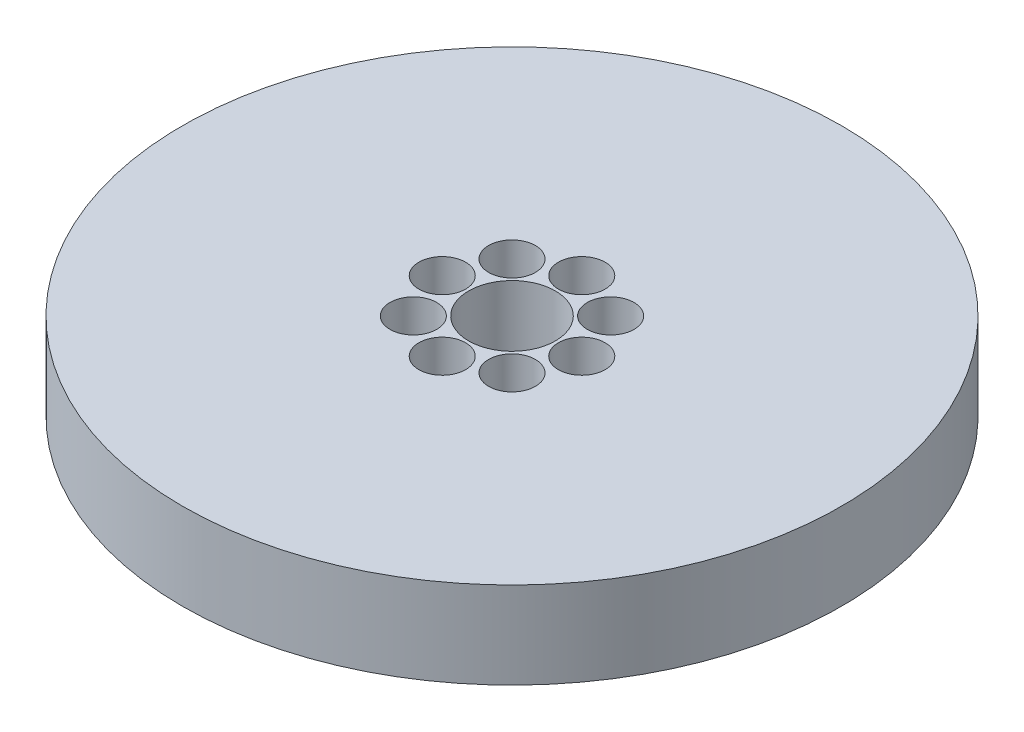
ISO-10303-21;
HEADER;
FILE_DESCRIPTION(('STEP AP214'),'2;1');
FILE_NAME('part.step','',(''),(''),'','','');
FILE_SCHEMA(('AUTOMOTIVE_DESIGN { 1 0 10303 214 1 1 1 1 }'));
ENDSEC;
DATA;
#1=APPLICATION_CONTEXT('core data for automotive mechanical design processes');
#2=APPLICATION_PROTOCOL_DEFINITION('international standard','automotive_design',2000,#1);
#3=PRODUCT_CONTEXT('',#1,'mechanical');
#4=PRODUCT('Part','Part','',(#3));
#5=PRODUCT_RELATED_PRODUCT_CATEGORY('part','',(#4));
#6=PRODUCT_DEFINITION_FORMATION('','',#4);
#7=PRODUCT_DEFINITION_CONTEXT('part definition',#1,'design');
#8=PRODUCT_DEFINITION('design','',#6,#7);
#9=PRODUCT_DEFINITION_SHAPE('','',#8);
#10=(LENGTH_UNIT() NAMED_UNIT(*) SI_UNIT(.MILLI.,.METRE.));
#11=(NAMED_UNIT(*) PLANE_ANGLE_UNIT() SI_UNIT($,.RADIAN.));
#12=(NAMED_UNIT(*) SI_UNIT($,.STERADIAN.) SOLID_ANGLE_UNIT());
#13=UNCERTAINTY_MEASURE_WITH_UNIT(LENGTH_MEASURE(1.E-05),#10,'distance_accuracy_value','');
#14=(GEOMETRIC_REPRESENTATION_CONTEXT(3) GLOBAL_UNCERTAINTY_ASSIGNED_CONTEXT((#13)) GLOBAL_UNIT_ASSIGNED_CONTEXT((#10,
#11,#12)) REPRESENTATION_CONTEXT('',''));
#15=CARTESIAN_POINT('',(0.,0.,0.));
#16=DIRECTION('',(0.,0.,1.));
#17=DIRECTION('',(1.,0.,0.));
#18=AXIS2_PLACEMENT_3D('',#15,#16,#17);
#19=CARTESIAN_POINT('',(0.,25.,0.));
#20=DIRECTION('',(0.,-1.,0.));
#21=DIRECTION('',(0.,0.,-1.));
#22=AXIS2_PLACEMENT_3D('',#19,#20,#21);
#23=CYLINDRICAL_SURFACE('',#22,95.);
#24=CARTESIAN_POINT('',(0.,25.,0.));
#25=DIRECTION('',(0.,1.,0.));
#26=DIRECTION('',(0.,0.,1.));
#27=AXIS2_PLACEMENT_3D('',#24,#25,#26);
#28=CIRCLE('',#27,95.);
#29=CARTESIAN_POINT('',(0.,25.,95.));
#30=VERTEX_POINT('',#29);
#31=EDGE_CURVE('E10',#30,#30,#28,.T.);
#32=ORIENTED_EDGE('',*,*,#31,.F.);
#33=EDGE_LOOP('',(#32));
#34=FACE_BOUND('',#33,.T.);
#35=CARTESIAN_POINT('',(0.,0.,0.));
#36=DIRECTION('',(0.,1.,0.));
#37=DIRECTION('',(0.,0.,1.));
#38=AXIS2_PLACEMENT_3D('',#35,#36,#37);
#39=CIRCLE('',#38,95.);
#40=CARTESIAN_POINT('',(0.,0.,95.));
#41=VERTEX_POINT('',#40);
#42=EDGE_CURVE('E37',#41,#41,#39,.T.);
#43=ORIENTED_EDGE('',*,*,#42,.T.);
#44=EDGE_LOOP('',(#43));
#45=FACE_BOUND('',#44,.T.);
#46=ADVANCED_FACE('F40',(#34,#45),#23,.T.);
#47=CARTESIAN_POINT('',(0.,25.,0.));
#48=DIRECTION('',(0.,1.,0.));
#49=DIRECTION('',(0.,0.,1.));
#50=AXIS2_PLACEMENT_3D('',#47,#48,#49);
#51=PLANE('',#50);
#52=CARTESIAN_POINT('',(0.,25.,20.1113184445712));
#53=DIRECTION('',(0.,1.,0.));
#54=DIRECTION('',(1.,0.,0.));
#55=AXIS2_PLACEMENT_3D('',#52,#53,#54);
#56=CIRCLE('',#55,6.73722952965365);
#57=CARTESIAN_POINT('',(6.73722952965372,25.,20.1113184445712));
#58=VERTEX_POINT('',#57);
#59=EDGE_CURVE('E88',#58,#58,#56,.T.);
#60=ORIENTED_EDGE('',*,*,#59,.F.);
#61=EDGE_LOOP('',(#60));
#62=FACE_BOUND('',#61,.T.);
#63=CARTESIAN_POINT('',(14.2208496507585,25.,14.2208496507583));
#64=DIRECTION('',(0.,1.,0.));
#65=DIRECTION('',(0.707106781186544,0.,-0.707106781186551));
#66=AXIS2_PLACEMENT_3D('',#63,#64,#65);
#67=CIRCLE('',#66,6.73722952965365);
#68=CARTESIAN_POINT('',(18.9847903375868,25.,9.45690896392992));
#69=VERTEX_POINT('',#68);
#70=EDGE_CURVE('E79',#69,#69,#67,.T.);
#71=ORIENTED_EDGE('',*,*,#70,.F.);
#72=EDGE_LOOP('',(#71));
#73=FACE_BOUND('',#72,.T.);
#74=CARTESIAN_POINT('',(20.1113184445712,25.,0.));
#75=DIRECTION('',(0.,1.,0.));
#76=DIRECTION('',(0.,0.,-1.));
#77=AXIS2_PLACEMENT_3D('',#74,#75,#76);
#78=CIRCLE('',#77,6.73722952965365);
#79=CARTESIAN_POINT('',(20.1113184445712,25.,-6.73722952965365));
#80=VERTEX_POINT('',#79);
#81=EDGE_CURVE('E74',#80,#80,#78,.T.);
#82=ORIENTED_EDGE('',*,*,#81,.F.);
#83=EDGE_LOOP('',(#82));
#84=FACE_BOUND('',#83,.T.);
#85=CARTESIAN_POINT('',(14.2208496507583,25.,-14.2208496507585));
#86=DIRECTION('',(0.,1.,0.));
#87=DIRECTION('',(-0.707106781186554,0.,-0.707106781186541));
#88=AXIS2_PLACEMENT_3D('',#85,#86,#87);
#89=CIRCLE('',#88,6.73722952965365);
#90=CARTESIAN_POINT('',(9.45690896392986,25.,-18.9847903375868));
#91=VERTEX_POINT('',#90);
#92=EDGE_CURVE('E70',#91,#91,#89,.T.);
#93=ORIENTED_EDGE('',*,*,#92,.F.);
#94=EDGE_LOOP('',(#93));
#95=FACE_BOUND('',#94,.T.);
#96=CARTESIAN_POINT('',(-2.10654879146256E-13,25.,-20.1113184445712));
#97=DIRECTION('',(0.,1.,0.));
#98=DIRECTION('',(-1.,0.,0.));
#99=AXIS2_PLACEMENT_3D('',#96,#97,#98);
#100=CIRCLE('',#99,6.73722952965365);
#101=CARTESIAN_POINT('',(-6.73722952965386,25.,-20.1113184445711));
#102=VERTEX_POINT('',#101);
#103=EDGE_CURVE('E100',#102,#102,#100,.T.);
#104=ORIENTED_EDGE('',*,*,#103,.F.);
#105=EDGE_LOOP('',(#104));
#106=FACE_BOUND('',#105,.T.);
#107=CARTESIAN_POINT('',(-14.2208496507586,25.,-14.2208496507582));
#108=DIRECTION('',(0.,1.,0.));
#109=DIRECTION('',(-0.707106781186539,0.,0.707106781186556));
#110=AXIS2_PLACEMENT_3D('',#107,#108,#109);
#111=CIRCLE('',#110,6.73722952965365);
#112=CARTESIAN_POINT('',(-18.9847903375868,25.,-9.45690896392979));
#113=VERTEX_POINT('',#112);
#114=EDGE_CURVE('E93',#113,#113,#111,.T.);
#115=ORIENTED_EDGE('',*,*,#114,.F.);
#116=EDGE_LOOP('',(#115));
#117=FACE_BOUND('',#116,.T.);
#118=CARTESIAN_POINT('',(-14.2208496507584,25.,14.2208496507584));
#119=DIRECTION('',(0.,1.,0.));
#120=DIRECTION('',(0.707106781186549,0.,0.707106781186546));
#121=AXIS2_PLACEMENT_3D('',#118,#119,#120);
#122=CIRCLE('',#121,6.73722952965365);
#123=CARTESIAN_POINT('',(-9.45690896392999,25.,18.9847903375867));
#124=VERTEX_POINT('',#123);
#125=EDGE_CURVE('E61',#124,#124,#122,.T.);
#126=ORIENTED_EDGE('',*,*,#125,.F.);
#127=EDGE_LOOP('',(#126));
#128=FACE_BOUND('',#127,.T.);
#129=CARTESIAN_POINT('',(-20.1113184445712,25.,0.));
#130=DIRECTION('',(0.,1.,0.));
#131=DIRECTION('',(0.,0.,1.));
#132=AXIS2_PLACEMENT_3D('',#129,#130,#131);
#133=CIRCLE('',#132,6.73722952965365);
#134=CARTESIAN_POINT('',(-20.1113184445712,25.,6.73722952965365));
#135=VERTEX_POINT('',#134);
#136=EDGE_CURVE('E54',#135,#135,#133,.T.);
#137=ORIENTED_EDGE('',*,*,#136,.F.);
#138=EDGE_LOOP('',(#137));
#139=FACE_BOUND('',#138,.T.);
#140=CARTESIAN_POINT('',(0.,25.,0.));
#141=DIRECTION('',(0.,1.,0.));
#142=DIRECTION('',(0.,0.,1.));
#143=AXIS2_PLACEMENT_3D('',#140,#141,#142);
#144=CIRCLE('',#143,12.5);
#145=CARTESIAN_POINT('',(0.,25.,12.5));
#146=VERTEX_POINT('',#145);
#147=EDGE_CURVE('E50',#146,#146,#144,.T.);
#148=ORIENTED_EDGE('',*,*,#147,.F.);
#149=EDGE_LOOP('',(#148));
#150=FACE_BOUND('',#149,.T.);
#151=ORIENTED_EDGE('',*,*,#31,.T.);
#152=EDGE_LOOP('',(#151));
#153=FACE_BOUND('',#152,.T.);
#154=ADVANCED_FACE('F115',(#62,#73,#84,#95,#106,#117,#128,#139,#150,#153),#51,.T.);
#155=CARTESIAN_POINT('',(0.,0.,0.));
#156=DIRECTION('',(0.,1.,0.));
#157=DIRECTION('',(0.,0.,1.));
#158=AXIS2_PLACEMENT_3D('',#155,#156,#157);
#159=PLANE('',#158);
#160=CARTESIAN_POINT('',(0.,0.,0.));
#161=DIRECTION('',(0.,1.,0.));
#162=DIRECTION('',(0.,0.,1.));
#163=AXIS2_PLACEMENT_3D('',#160,#161,#162);
#164=CIRCLE('',#163,12.5);
#165=CARTESIAN_POINT('',(0.,0.,12.5));
#166=VERTEX_POINT('',#165);
#167=EDGE_CURVE('E47',#166,#166,#164,.T.);
#168=ORIENTED_EDGE('',*,*,#167,.T.);
#169=EDGE_LOOP('',(#168));
#170=FACE_BOUND('',#169,.T.);
#171=ORIENTED_EDGE('',*,*,#42,.F.);
#172=EDGE_LOOP('',(#171));
#173=FACE_BOUND('',#172,.T.);
#174=ADVANCED_FACE('F113',(#170,#173),#159,.F.);
#175=CARTESIAN_POINT('',(0.,25.,0.));
#176=DIRECTION('',(0.,-1.,0.));
#177=DIRECTION('',(0.,0.,-1.));
#178=AXIS2_PLACEMENT_3D('',#175,#176,#177);
#179=CYLINDRICAL_SURFACE('',#178,12.5);
#180=ORIENTED_EDGE('',*,*,#147,.T.);
#181=EDGE_LOOP('',(#180));
#182=FACE_BOUND('',#181,.T.);
#183=ORIENTED_EDGE('',*,*,#167,.F.);
#184=EDGE_LOOP('',(#183));
#185=FACE_BOUND('',#184,.T.);
#186=ADVANCED_FACE('F127',(#182,#185),#179,.F.);
#187=CARTESIAN_POINT('',(-20.1113184445712,5.72889707920388,0.));
#188=DIRECTION('',(0.,1.,0.));
#189=DIRECTION('',(0.,0.,1.));
#190=AXIS2_PLACEMENT_3D('',#187,#188,#189);
#191=CYLINDRICAL_SURFACE('',#190,6.73722952965365);
#192=CARTESIAN_POINT('',(-20.1113184445712,5.72889707920388,0.));
#193=DIRECTION('',(0.,1.,0.));
#194=DIRECTION('',(0.,0.,1.));
#195=AXIS2_PLACEMENT_3D('',#192,#193,#194);
#196=CIRCLE('',#195,6.73722952965365);
#197=CARTESIAN_POINT('',(-20.1113184445712,5.72889707920388,6.73722952965365));
#198=VERTEX_POINT('',#197);
#199=EDGE_CURVE('E55',#198,#198,#196,.T.);
#200=ORIENTED_EDGE('',*,*,#199,.F.);
#201=EDGE_LOOP('',(#200));
#202=FACE_BOUND('',#201,.T.);
#203=ORIENTED_EDGE('',*,*,#136,.T.);
#204=EDGE_LOOP('',(#203));
#205=FACE_BOUND('',#204,.T.);
#206=ADVANCED_FACE('F129',(#202,#205),#191,.F.);
#207=CARTESIAN_POINT('',(-20.1113184445712,5.72889707920388,0.));
#208=DIRECTION('',(0.,1.,0.));
#209=DIRECTION('',(0.,0.,1.));
#210=AXIS2_PLACEMENT_3D('',#207,#208,#209);
#211=PLANE('',#210);
#212=ORIENTED_EDGE('',*,*,#199,.T.);
#213=EDGE_LOOP('',(#212));
#214=FACE_BOUND('',#213,.T.);
#215=ADVANCED_FACE('F157',(#214),#211,.T.);
#216=CARTESIAN_POINT('',(-14.2208496507584,5.72889707920388,14.2208496507584));
#217=DIRECTION('',(0.,1.,0.));
#218=DIRECTION('',(0.,0.,1.));
#219=AXIS2_PLACEMENT_3D('',#216,#217,#218);
#220=CYLINDRICAL_SURFACE('',#219,6.73722952965365);
#221=CARTESIAN_POINT('',(-14.2208496507584,5.72889707920388,14.2208496507584));
#222=DIRECTION('',(0.,1.,0.));
#223=DIRECTION('',(0.707106781186549,0.,0.707106781186546));
#224=AXIS2_PLACEMENT_3D('',#221,#222,#223);
#225=CIRCLE('',#224,6.73722952965365);
#226=CARTESIAN_POINT('',(-9.45690896392999,5.72889707920388,18.9847903375867));
#227=VERTEX_POINT('',#226);
#228=EDGE_CURVE('E59',#227,#227,#225,.T.);
#229=ORIENTED_EDGE('',*,*,#228,.F.);
#230=EDGE_LOOP('',(#229));
#231=FACE_BOUND('',#230,.T.);
#232=ORIENTED_EDGE('',*,*,#125,.T.);
#233=EDGE_LOOP('',(#232));
#234=FACE_BOUND('',#233,.T.);
#235=ADVANCED_FACE('F170',(#231,#234),#220,.F.);
#236=CARTESIAN_POINT('',(-14.2208496507584,5.72889707920388,14.2208496507584));
#237=DIRECTION('',(0.,1.,0.));
#238=DIRECTION('',(0.707106781186549,0.,0.707106781186546));
#239=AXIS2_PLACEMENT_3D('',#236,#237,#238);
#240=PLANE('',#239);
#241=ORIENTED_EDGE('',*,*,#228,.T.);
#242=EDGE_LOOP('',(#241));
#243=FACE_BOUND('',#242,.T.);
#244=ADVANCED_FACE('F182',(#243),#240,.T.);
#245=CARTESIAN_POINT('',(-14.2208496507586,5.72889707920388,-14.2208496507582));
#246=DIRECTION('',(0.,1.,0.));
#247=DIRECTION('',(0.,0.,1.));
#248=AXIS2_PLACEMENT_3D('',#245,#246,#247);
#249=CYLINDRICAL_SURFACE('',#248,6.73722952965365);
#250=CARTESIAN_POINT('',(-14.2208496507586,5.72889707920388,-14.2208496507582));
#251=DIRECTION('',(0.,1.,0.));
#252=DIRECTION('',(-0.707106781186539,0.,0.707106781186556));
#253=AXIS2_PLACEMENT_3D('',#250,#251,#252);
#254=CIRCLE('',#253,6.73722952965365);
#255=CARTESIAN_POINT('',(-18.9847903375868,5.72889707920388,-9.45690896392979));
#256=VERTEX_POINT('',#255);
#257=EDGE_CURVE('E94',#256,#256,#254,.T.);
#258=ORIENTED_EDGE('',*,*,#257,.F.);
#259=EDGE_LOOP('',(#258));
#260=FACE_BOUND('',#259,.T.);
#261=ORIENTED_EDGE('',*,*,#114,.T.);
#262=EDGE_LOOP('',(#261));
#263=FACE_BOUND('',#262,.T.);
#264=ADVANCED_FACE('F189',(#260,#263),#249,.F.);
#265=CARTESIAN_POINT('',(-14.2208496507586,5.72889707920388,-14.2208496507582));
#266=DIRECTION('',(0.,1.,0.));
#267=DIRECTION('',(-0.707106781186539,0.,0.707106781186556));
#268=AXIS2_PLACEMENT_3D('',#265,#266,#267);
#269=PLANE('',#268);
#270=ORIENTED_EDGE('',*,*,#257,.T.);
#271=EDGE_LOOP('',(#270));
#272=FACE_BOUND('',#271,.T.);
#273=ADVANCED_FACE('F107',(#272),#269,.T.);
#274=CARTESIAN_POINT('',(-2.10654879146256E-13,5.72889707920388,-20.1113184445712));
#275=DIRECTION('',(0.,1.,0.));
#276=DIRECTION('',(0.,0.,1.));
#277=AXIS2_PLACEMENT_3D('',#274,#275,#276);
#278=CYLINDRICAL_SURFACE('',#277,6.73722952965365);
#279=CARTESIAN_POINT('',(-2.10654879146256E-13,5.72889707920388,-20.1113184445712));
#280=DIRECTION('',(0.,1.,0.));
#281=DIRECTION('',(-1.,0.,0.));
#282=AXIS2_PLACEMENT_3D('',#279,#280,#281);
#283=CIRCLE('',#282,6.73722952965365);
#284=CARTESIAN_POINT('',(-6.73722952965386,5.72889707920388,-20.1113184445711));
#285=VERTEX_POINT('',#284);
#286=EDGE_CURVE('E72',#285,#285,#283,.T.);
#287=ORIENTED_EDGE('',*,*,#286,.F.);
#288=EDGE_LOOP('',(#287));
#289=FACE_BOUND('',#288,.T.);
#290=ORIENTED_EDGE('',*,*,#103,.T.);
#291=EDGE_LOOP('',(#290));
#292=FACE_BOUND('',#291,.T.);
#293=ADVANCED_FACE('F104',(#289,#292),#278,.F.);
#294=CARTESIAN_POINT('',(-2.10654879146256E-13,5.72889707920388,-20.1113184445712));
#295=DIRECTION('',(0.,1.,0.));
#296=DIRECTION('',(-1.,0.,0.));
#297=AXIS2_PLACEMENT_3D('',#294,#295,#296);
#298=PLANE('',#297);
#299=ORIENTED_EDGE('',*,*,#286,.T.);
#300=EDGE_LOOP('',(#299));
#301=FACE_BOUND('',#300,.T.);
#302=ADVANCED_FACE('F103',(#301),#298,.T.);
#303=CARTESIAN_POINT('',(14.2208496507583,5.72889707920388,-14.2208496507585));
#304=DIRECTION('',(0.,1.,0.));
#305=DIRECTION('',(0.,0.,1.));
#306=AXIS2_PLACEMENT_3D('',#303,#304,#305);
#307=CYLINDRICAL_SURFACE('',#306,6.73722952965365);
#308=CARTESIAN_POINT('',(14.2208496507583,5.72889707920388,-14.2208496507585));
#309=DIRECTION('',(0.,1.,0.));
#310=DIRECTION('',(-0.707106781186554,0.,-0.707106781186541));
#311=AXIS2_PLACEMENT_3D('',#308,#309,#310);
#312=CIRCLE('',#311,6.73722952965365);
#313=CARTESIAN_POINT('',(9.45690896392986,5.72889707920388,-18.9847903375868));
#314=VERTEX_POINT('',#313);
#315=EDGE_CURVE('E69',#314,#314,#312,.T.);
#316=ORIENTED_EDGE('',*,*,#315,.F.);
#317=EDGE_LOOP('',(#316));
#318=FACE_BOUND('',#317,.T.);
#319=ORIENTED_EDGE('',*,*,#92,.T.);
#320=EDGE_LOOP('',(#319));
#321=FACE_BOUND('',#320,.T.);
#322=ADVANCED_FACE('F219',(#318,#321),#307,.F.);
#323=CARTESIAN_POINT('',(14.2208496507583,5.72889707920388,-14.2208496507585));
#324=DIRECTION('',(0.,1.,0.));
#325=DIRECTION('',(-0.707106781186554,0.,-0.707106781186541));
#326=AXIS2_PLACEMENT_3D('',#323,#324,#325);
#327=PLANE('',#326);
#328=ORIENTED_EDGE('',*,*,#315,.T.);
#329=EDGE_LOOP('',(#328));
#330=FACE_BOUND('',#329,.T.);
#331=ADVANCED_FACE('F227',(#330),#327,.T.);
#332=CARTESIAN_POINT('',(20.1113184445712,5.72889707920388,0.));
#333=DIRECTION('',(0.,1.,0.));
#334=DIRECTION('',(0.,0.,1.));
#335=AXIS2_PLACEMENT_3D('',#332,#333,#334);
#336=CYLINDRICAL_SURFACE('',#335,6.73722952965365);
#337=CARTESIAN_POINT('',(20.1113184445712,5.72889707920388,0.));
#338=DIRECTION('',(0.,1.,0.));
#339=DIRECTION('',(0.,0.,-1.));
#340=AXIS2_PLACEMENT_3D('',#337,#338,#339);
#341=CIRCLE('',#340,6.73722952965365);
#342=CARTESIAN_POINT('',(20.1113184445712,5.72889707920388,-6.73722952965365));
#343=VERTEX_POINT('',#342);
#344=EDGE_CURVE('E80',#343,#343,#341,.T.);
#345=ORIENTED_EDGE('',*,*,#344,.F.);
#346=EDGE_LOOP('',(#345));
#347=FACE_BOUND('',#346,.T.);
#348=ORIENTED_EDGE('',*,*,#81,.T.);
#349=EDGE_LOOP('',(#348));
#350=FACE_BOUND('',#349,.T.);
#351=ADVANCED_FACE('F240',(#347,#350),#336,.F.);
#352=CARTESIAN_POINT('',(20.1113184445712,5.72889707920388,0.));
#353=DIRECTION('',(0.,1.,0.));
#354=DIRECTION('',(0.,0.,-1.));
#355=AXIS2_PLACEMENT_3D('',#352,#353,#354);
#356=PLANE('',#355);
#357=ORIENTED_EDGE('',*,*,#344,.T.);
#358=EDGE_LOOP('',(#357));
#359=FACE_BOUND('',#358,.T.);
#360=ADVANCED_FACE('F246',(#359),#356,.T.);
#361=CARTESIAN_POINT('',(14.2208496507585,5.72889707920388,14.2208496507583));
#362=DIRECTION('',(0.,1.,0.));
#363=DIRECTION('',(0.,0.,1.));
#364=AXIS2_PLACEMENT_3D('',#361,#362,#363);
#365=CYLINDRICAL_SURFACE('',#364,6.73722952965365);
#366=CARTESIAN_POINT('',(14.2208496507585,5.72889707920388,14.2208496507583));
#367=DIRECTION('',(0.,1.,0.));
#368=DIRECTION('',(0.707106781186544,0.,-0.707106781186551));
#369=AXIS2_PLACEMENT_3D('',#366,#367,#368);
#370=CIRCLE('',#369,6.73722952965365);
#371=CARTESIAN_POINT('',(18.9847903375868,5.72889707920388,9.45690896392992));
#372=VERTEX_POINT('',#371);
#373=EDGE_CURVE('E82',#372,#372,#370,.T.);
#374=ORIENTED_EDGE('',*,*,#373,.F.);
#375=EDGE_LOOP('',(#374));
#376=FACE_BOUND('',#375,.T.);
#377=ORIENTED_EDGE('',*,*,#70,.T.);
#378=EDGE_LOOP('',(#377));
#379=FACE_BOUND('',#378,.T.);
#380=ADVANCED_FACE('F254',(#376,#379),#365,.F.);
#381=CARTESIAN_POINT('',(14.2208496507585,5.72889707920388,14.2208496507583));
#382=DIRECTION('',(0.,1.,0.));
#383=DIRECTION('',(0.707106781186544,0.,-0.707106781186551));
#384=AXIS2_PLACEMENT_3D('',#381,#382,#383);
#385=PLANE('',#384);
#386=ORIENTED_EDGE('',*,*,#373,.T.);
#387=EDGE_LOOP('',(#386));
#388=FACE_BOUND('',#387,.T.);
#389=ADVANCED_FACE('F262',(#388),#385,.T.);
#390=CARTESIAN_POINT('',(0.,5.72889707920388,20.1113184445712));
#391=DIRECTION('',(0.,1.,0.));
#392=DIRECTION('',(0.,0.,1.));
#393=AXIS2_PLACEMENT_3D('',#390,#391,#392);
#394=CYLINDRICAL_SURFACE('',#393,6.73722952965365);
#395=CARTESIAN_POINT('',(0.,5.72889707920388,20.1113184445712));
#396=DIRECTION('',(0.,1.,0.));
#397=DIRECTION('',(1.,0.,0.));
#398=AXIS2_PLACEMENT_3D('',#395,#396,#397);
#399=CIRCLE('',#398,6.73722952965365);
#400=CARTESIAN_POINT('',(6.73722952965372,5.72889707920388,20.1113184445712));
#401=VERTEX_POINT('',#400);
#402=EDGE_CURVE('E63',#401,#401,#399,.T.);
#403=ORIENTED_EDGE('',*,*,#402,.F.);
#404=EDGE_LOOP('',(#403));
#405=FACE_BOUND('',#404,.T.);
#406=ORIENTED_EDGE('',*,*,#59,.T.);
#407=EDGE_LOOP('',(#406));
#408=FACE_BOUND('',#407,.T.);
#409=ADVANCED_FACE('F272',(#405,#408),#394,.F.);
#410=CARTESIAN_POINT('',(0.,5.72889707920388,20.1113184445712));
#411=DIRECTION('',(0.,1.,0.));
#412=DIRECTION('',(1.,0.,0.));
#413=AXIS2_PLACEMENT_3D('',#410,#411,#412);
#414=PLANE('',#413);
#415=ORIENTED_EDGE('',*,*,#402,.T.);
#416=EDGE_LOOP('',(#415));
#417=FACE_BOUND('',#416,.T.);
#418=ADVANCED_FACE('F285',(#417),#414,.T.);
#419=CLOSED_SHELL('',(#46,#154,#174,#186,#206,#215,#235,#244,#264,#273,#293,#302,#322,#331,#351,
#360,#380,#389,#409,#418));
#420=MANIFOLD_SOLID_BREP('B2',#419);
#421=ADVANCED_BREP_SHAPE_REPRESENTATION('',(#18,#420),#14);
#422=SHAPE_DEFINITION_REPRESENTATION(#9,#421);
ENDSEC;
END-ISO-10303-21;
